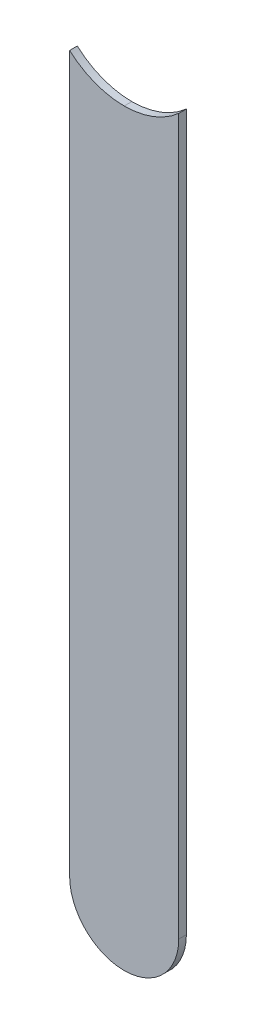
ISO-10303-21;
HEADER;
FILE_DESCRIPTION(('STEP AP214'),'2;1');
FILE_NAME('part.step','',(''),(''),'','','');
FILE_SCHEMA(('AUTOMOTIVE_DESIGN { 1 0 10303 214 1 1 1 1 }'));
ENDSEC;
DATA;
#1=APPLICATION_CONTEXT('core data for automotive mechanical design processes');
#2=APPLICATION_PROTOCOL_DEFINITION('international standard','automotive_design',2000,#1);
#3=PRODUCT_CONTEXT('',#1,'mechanical');
#4=PRODUCT('Part','Part','',(#3));
#5=PRODUCT_RELATED_PRODUCT_CATEGORY('part','',(#4));
#6=PRODUCT_DEFINITION_FORMATION('','',#4);
#7=PRODUCT_DEFINITION_CONTEXT('part definition',#1,'design');
#8=PRODUCT_DEFINITION('design','',#6,#7);
#9=PRODUCT_DEFINITION_SHAPE('','',#8);
#10=(LENGTH_UNIT() NAMED_UNIT(*) SI_UNIT(.MILLI.,.METRE.));
#11=(NAMED_UNIT(*) PLANE_ANGLE_UNIT() SI_UNIT($,.RADIAN.));
#12=(NAMED_UNIT(*) SI_UNIT($,.STERADIAN.) SOLID_ANGLE_UNIT());
#13=UNCERTAINTY_MEASURE_WITH_UNIT(LENGTH_MEASURE(1.E-05),#10,'distance_accuracy_value','');
#14=(GEOMETRIC_REPRESENTATION_CONTEXT(3) GLOBAL_UNCERTAINTY_ASSIGNED_CONTEXT((#13)) GLOBAL_UNIT_ASSIGNED_CONTEXT((#10,
#11,#12)) REPRESENTATION_CONTEXT('',''));
#15=CARTESIAN_POINT('',(0.,0.,0.));
#16=DIRECTION('',(0.,0.,1.));
#17=DIRECTION('',(1.,0.,0.));
#18=AXIS2_PLACEMENT_3D('',#15,#16,#17);
#19=CARTESIAN_POINT('',(152.4,-80.772,-0.045));
#20=DIRECTION('',(0.,0.,-1.));
#21=DIRECTION('',(0.,-1.,0.));
#22=AXIS2_PLACEMENT_3D('',#19,#20,#21);
#23=CYLINDRICAL_SURFACE('',#22,0.375);
#24=DIRECTION('',(0.,0.,1.));
#25=VECTOR('',#24,1.);
#26=CARTESIAN_POINT('',(152.4,-81.147,-0.045));
#27=LINE('',#26,#25);
#28=CARTESIAN_POINT('',(152.4,-81.147,-0.035));
#29=VERTEX_POINT('',#28);
#30=CARTESIAN_POINT('',(152.4,-81.147,0.));
#31=VERTEX_POINT('',#30);
#32=EDGE_CURVE('E58',#29,#31,#27,.T.);
#33=ORIENTED_EDGE('',*,*,#32,.F.);
#34=CARTESIAN_POINT('',(152.4,-80.772,-0.035));
#35=DIRECTION('',(0.,0.,-1.));
#36=DIRECTION('',(0.,-1.,0.));
#37=AXIS2_PLACEMENT_3D('',#34,#35,#36);
#38=CIRCLE('',#37,0.375);
#39=CARTESIAN_POINT('',(152.15,-81.05150849718,-0.035));
#40=VERTEX_POINT('',#39);
#41=EDGE_CURVE('E128',#29,#40,#38,.T.);
#42=ORIENTED_EDGE('',*,*,#41,.T.);
#43=DIRECTION('',(0.,0.,-1.));
#44=VECTOR('',#43,1.);
#45=CARTESIAN_POINT('',(152.15,-81.05150849718,-0.045));
#46=LINE('',#45,#44);
#47=CARTESIAN_POINT('',(152.15,-81.05150849718,0.));
#48=VERTEX_POINT('',#47);
#49=EDGE_CURVE('E11',#48,#40,#46,.T.);
#50=ORIENTED_EDGE('',*,*,#49,.F.);
#51=CARTESIAN_POINT('',(152.4,-80.772,0.));
#52=DIRECTION('',(0.,0.,-1.));
#53=DIRECTION('',(0.,-1.,0.));
#54=AXIS2_PLACEMENT_3D('',#51,#52,#53);
#55=CIRCLE('',#54,0.375);
#56=EDGE_CURVE('E55',#31,#48,#55,.T.);
#57=ORIENTED_EDGE('',*,*,#56,.F.);
#58=EDGE_LOOP('',(#33,#42,#50,#57));
#59=FACE_BOUND('',#58,.T.);
#60=ADVANCED_FACE('F17',(#59),#23,.F.);
#61=CARTESIAN_POINT('',(152.15,-80.772,-0.035));
#62=DIRECTION('',(1.,0.,0.));
#63=DIRECTION('',(0.,1.,0.));
#64=AXIS2_PLACEMENT_3D('',#61,#62,#63);
#65=PLANE('',#64);
#66=DIRECTION('',(0.,0.,1.));
#67=VECTOR('',#66,1.);
#68=CARTESIAN_POINT('',(152.15,-84.328,-0.035));
#69=LINE('',#68,#67);
#70=CARTESIAN_POINT('',(152.15,-84.328,-0.035));
#71=VERTEX_POINT('',#70);
#72=CARTESIAN_POINT('',(152.15,-84.328,0.));
#73=VERTEX_POINT('',#72);
#74=EDGE_CURVE('E27',#71,#73,#69,.T.);
#75=ORIENTED_EDGE('',*,*,#74,.T.);
#76=DIRECTION('',(0.,-1.,0.));
#77=VECTOR('',#76,1.);
#78=CARTESIAN_POINT('',(152.15,-80.772,0.));
#79=LINE('',#78,#77);
#80=EDGE_CURVE('E63',#48,#73,#79,.T.);
#81=ORIENTED_EDGE('',*,*,#80,.F.);
#82=ORIENTED_EDGE('',*,*,#49,.T.);
#83=DIRECTION('',(0.,-1.,0.));
#84=VECTOR('',#83,1.);
#85=CARTESIAN_POINT('',(152.15,-80.772,-0.035));
#86=LINE('',#85,#84);
#87=EDGE_CURVE('E130',#40,#71,#86,.T.);
#88=ORIENTED_EDGE('',*,*,#87,.T.);
#89=EDGE_LOOP('',(#75,#81,#82,#88));
#90=FACE_BOUND('',#89,.T.);
#91=ADVANCED_FACE('F140',(#90),#65,.F.);
#92=CARTESIAN_POINT('',(152.4,-84.328,-0.035));
#93=DIRECTION('',(0.,0.,-1.));
#94=DIRECTION('',(-1.,0.,0.));
#95=AXIS2_PLACEMENT_3D('',#92,#93,#94);
#96=CYLINDRICAL_SURFACE('',#95,0.25);
#97=CARTESIAN_POINT('',(152.4,-84.328,-0.035));
#98=DIRECTION('',(0.,0.,1.));
#99=DIRECTION('',(-1.,0.,0.));
#100=AXIS2_PLACEMENT_3D('',#97,#98,#99);
#101=CIRCLE('',#100,0.25);
#102=CARTESIAN_POINT('',(152.65,-84.328,-0.035));
#103=VERTEX_POINT('',#102);
#104=EDGE_CURVE('E84',#71,#103,#101,.T.);
#105=ORIENTED_EDGE('',*,*,#104,.T.);
#106=DIRECTION('',(0.,0.,1.));
#107=VECTOR('',#106,1.);
#108=CARTESIAN_POINT('',(152.65,-84.328,-0.035));
#109=LINE('',#108,#107);
#110=CARTESIAN_POINT('',(152.65,-84.328,0.));
#111=VERTEX_POINT('',#110);
#112=EDGE_CURVE('E106',#103,#111,#109,.T.);
#113=ORIENTED_EDGE('',*,*,#112,.T.);
#114=CARTESIAN_POINT('',(152.4,-84.328,0.));
#115=DIRECTION('',(0.,0.,1.));
#116=DIRECTION('',(-1.,0.,0.));
#117=AXIS2_PLACEMENT_3D('',#114,#115,#116);
#118=CIRCLE('',#117,0.25);
#119=EDGE_CURVE('E64',#73,#111,#118,.T.);
#120=ORIENTED_EDGE('',*,*,#119,.F.);
#121=ORIENTED_EDGE('',*,*,#74,.F.);
#122=EDGE_LOOP('',(#105,#113,#120,#121));
#123=FACE_BOUND('',#122,.T.);
#124=ADVANCED_FACE('F19',(#123),#96,.T.);
#125=CARTESIAN_POINT('',(152.65,-84.328,0.));
#126=DIRECTION('',(0.,0.,1.));
#127=DIRECTION('',(1.,0.,0.));
#128=AXIS2_PLACEMENT_3D('',#125,#126,#127);
#129=PLANE('',#128);
#130=ORIENTED_EDGE('',*,*,#119,.T.);
#131=DIRECTION('',(0.,1.,0.));
#132=VECTOR('',#131,1.);
#133=CARTESIAN_POINT('',(152.65,-84.328,0.));
#134=LINE('',#133,#132);
#135=CARTESIAN_POINT('',(152.65,-81.05150849717,0.));
#136=VERTEX_POINT('',#135);
#137=EDGE_CURVE('E73',#111,#136,#134,.T.);
#138=ORIENTED_EDGE('',*,*,#137,.T.);
#139=CARTESIAN_POINT('',(152.4,-80.772,0.));
#140=DIRECTION('',(0.,0.,-1.));
#141=DIRECTION('',(0.,-1.,0.));
#142=AXIS2_PLACEMENT_3D('',#139,#140,#141);
#143=CIRCLE('',#142,0.375);
#144=EDGE_CURVE('E68',#136,#31,#143,.T.);
#145=ORIENTED_EDGE('',*,*,#144,.T.);
#146=ORIENTED_EDGE('',*,*,#56,.T.);
#147=ORIENTED_EDGE('',*,*,#80,.T.);
#148=EDGE_LOOP('',(#130,#138,#145,#146,#147));
#149=FACE_BOUND('',#148,.T.);
#150=ADVANCED_FACE('F70',(#149),#129,.T.);
#151=CARTESIAN_POINT('',(152.4,-80.772,-0.045));
#152=DIRECTION('',(0.,0.,-1.));
#153=DIRECTION('',(0.,-1.,0.));
#154=AXIS2_PLACEMENT_3D('',#151,#152,#153);
#155=CYLINDRICAL_SURFACE('',#154,0.375);
#156=CARTESIAN_POINT('',(152.4,-80.772,-0.035));
#157=DIRECTION('',(0.,0.,-1.));
#158=DIRECTION('',(0.,-1.,0.));
#159=AXIS2_PLACEMENT_3D('',#156,#157,#158);
#160=CIRCLE('',#159,0.375);
#161=CARTESIAN_POINT('',(152.65,-81.05150849717,-0.035));
#162=VERTEX_POINT('',#161);
#163=EDGE_CURVE('E81',#162,#29,#160,.T.);
#164=ORIENTED_EDGE('',*,*,#163,.T.);
#165=ORIENTED_EDGE('',*,*,#32,.T.);
#166=ORIENTED_EDGE('',*,*,#144,.F.);
#167=DIRECTION('',(0.,0.,-1.));
#168=VECTOR('',#167,1.);
#169=CARTESIAN_POINT('',(152.65,-81.05150849718,-0.045));
#170=LINE('',#169,#168);
#171=EDGE_CURVE('E118',#136,#162,#170,.T.);
#172=ORIENTED_EDGE('',*,*,#171,.T.);
#173=EDGE_LOOP('',(#164,#165,#166,#172));
#174=FACE_BOUND('',#173,.T.);
#175=ADVANCED_FACE('F79',(#174),#155,.F.);
#176=CARTESIAN_POINT('',(152.65,-84.328,-0.035));
#177=DIRECTION('',(0.,0.,1.));
#178=DIRECTION('',(1.,0.,0.));
#179=AXIS2_PLACEMENT_3D('',#176,#177,#178);
#180=PLANE('',#179);
#181=ORIENTED_EDGE('',*,*,#87,.F.);
#182=ORIENTED_EDGE('',*,*,#41,.F.);
#183=ORIENTED_EDGE('',*,*,#163,.F.);
#184=DIRECTION('',(0.,1.,0.));
#185=VECTOR('',#184,1.);
#186=CARTESIAN_POINT('',(152.65,-84.328,-0.035));
#187=LINE('',#186,#185);
#188=EDGE_CURVE('E115',#103,#162,#187,.T.);
#189=ORIENTED_EDGE('',*,*,#188,.F.);
#190=ORIENTED_EDGE('',*,*,#104,.F.);
#191=EDGE_LOOP('',(#181,#182,#183,#189,#190));
#192=FACE_BOUND('',#191,.T.);
#193=ADVANCED_FACE('F139',(#192),#180,.F.);
#194=CARTESIAN_POINT('',(152.65,-84.328,-0.035));
#195=DIRECTION('',(-1.,0.,0.));
#196=DIRECTION('',(0.,0.,1.));
#197=AXIS2_PLACEMENT_3D('',#194,#195,#196);
#198=PLANE('',#197);
#199=ORIENTED_EDGE('',*,*,#171,.F.);
#200=ORIENTED_EDGE('',*,*,#137,.F.);
#201=ORIENTED_EDGE('',*,*,#112,.F.);
#202=ORIENTED_EDGE('',*,*,#188,.T.);
#203=EDGE_LOOP('',(#199,#200,#201,#202));
#204=FACE_BOUND('',#203,.T.);
#205=ADVANCED_FACE('F117',(#204),#198,.F.);
#206=CLOSED_SHELL('',(#60,#91,#124,#150,#175,#193,#205));
#207=MANIFOLD_SOLID_BREP('B1',#206);
#208=ADVANCED_BREP_SHAPE_REPRESENTATION('',(#18,#207),#14);
#209=SHAPE_DEFINITION_REPRESENTATION(#9,#208);
ENDSEC;
END-ISO-10303-21;
